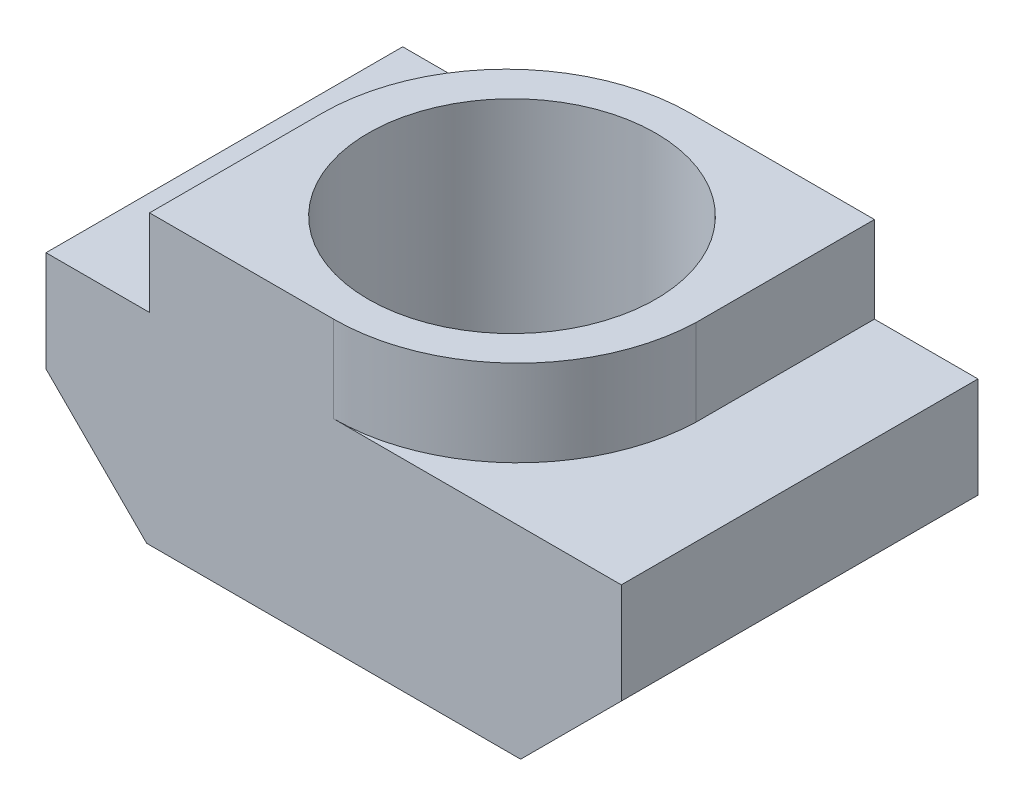
ISO-10303-21;
HEADER;
FILE_DESCRIPTION(('STEP AP214'),'2;1');
FILE_NAME('part.step','',(''),(''),'','','');
FILE_SCHEMA(('AUTOMOTIVE_DESIGN { 1 0 10303 214 1 1 1 1 }'));
ENDSEC;
DATA;
#1=APPLICATION_CONTEXT('core data for automotive mechanical design processes');
#2=APPLICATION_PROTOCOL_DEFINITION('international standard','automotive_design',2000,#1);
#3=PRODUCT_CONTEXT('',#1,'mechanical');
#4=PRODUCT('Part','Part','',(#3));
#5=PRODUCT_RELATED_PRODUCT_CATEGORY('part','',(#4));
#6=PRODUCT_DEFINITION_FORMATION('','',#4);
#7=PRODUCT_DEFINITION_CONTEXT('part definition',#1,'design');
#8=PRODUCT_DEFINITION('design','',#6,#7);
#9=PRODUCT_DEFINITION_SHAPE('','',#8);
#10=(LENGTH_UNIT() NAMED_UNIT(*) SI_UNIT(.MILLI.,.METRE.));
#11=(NAMED_UNIT(*) PLANE_ANGLE_UNIT() SI_UNIT($,.RADIAN.));
#12=(NAMED_UNIT(*) SI_UNIT($,.STERADIAN.) SOLID_ANGLE_UNIT());
#13=UNCERTAINTY_MEASURE_WITH_UNIT(LENGTH_MEASURE(1.E-05),#10,'distance_accuracy_value','');
#14=(GEOMETRIC_REPRESENTATION_CONTEXT(3) GLOBAL_UNCERTAINTY_ASSIGNED_CONTEXT((#13)) GLOBAL_UNIT_ASSIGNED_CONTEXT((#10,
#11,#12)) REPRESENTATION_CONTEXT('',''));
#15=CARTESIAN_POINT('',(0.,0.,0.));
#16=DIRECTION('',(0.,0.,1.));
#17=DIRECTION('',(1.,0.,0.));
#18=AXIS2_PLACEMENT_3D('',#15,#16,#17);
#19=CARTESIAN_POINT('',(3.2,5.,6.2));
#20=DIRECTION('',(0.,-1.,0.));
#21=DIRECTION('',(0.,0.,-1.));
#22=AXIS2_PLACEMENT_3D('',#19,#20,#21);
#23=PLANE('',#22);
#24=CARTESIAN_POINT('',(0.,5.,3.1));
#25=DIRECTION('',(0.,1.,0.));
#26=DIRECTION('',(0.,0.,1.));
#27=AXIS2_PLACEMENT_3D('',#24,#25,#26);
#28=CIRCLE('',#27,2.5);
#29=CARTESIAN_POINT('',(0.,5.,5.6));
#30=VERTEX_POINT('',#29);
#31=EDGE_CURVE('E167',#30,#30,#28,.T.);
#32=ORIENTED_EDGE('',*,*,#31,.F.);
#33=EDGE_LOOP('',(#32));
#34=FACE_BOUND('',#33,.T.);
#35=CARTESIAN_POINT('',(0.,5.,3.2));
#36=DIRECTION('',(0.,1.,0.));
#37=DIRECTION('',(0.,0.,1.));
#38=AXIS2_PLACEMENT_3D('',#35,#36,#37);
#39=CIRCLE('',#38,3.2);
#40=CARTESIAN_POINT('',(0.,5.,0.));
#41=VERTEX_POINT('',#40);
#42=CARTESIAN_POINT('',(-3.2,5.,3.2));
#43=VERTEX_POINT('',#42);
#44=EDGE_CURVE('E148',#41,#43,#39,.T.);
#45=ORIENTED_EDGE('',*,*,#44,.T.);
#46=DIRECTION('',(0.,0.,-1.));
#47=VECTOR('',#46,1.);
#48=CARTESIAN_POINT('',(-3.2,5.,6.2));
#49=LINE('',#48,#47);
#50=CARTESIAN_POINT('',(-3.2,5.,6.2));
#51=VERTEX_POINT('',#50);
#52=EDGE_CURVE('E181',#51,#43,#49,.T.);
#53=ORIENTED_EDGE('',*,*,#52,.F.);
#54=DIRECTION('',(-1.,0.,0.));
#55=VECTOR('',#54,1.);
#56=CARTESIAN_POINT('',(3.2,5.,6.2));
#57=LINE('',#56,#55);
#58=CARTESIAN_POINT('',(0.,5.,6.2));
#59=VERTEX_POINT('',#58);
#60=EDGE_CURVE('E197',#59,#51,#57,.T.);
#61=ORIENTED_EDGE('',*,*,#60,.F.);
#62=CARTESIAN_POINT('',(0.,5.,2.99838709677419));
#63=DIRECTION('',(0.,1.,0.));
#64=DIRECTION('',(0.,0.,1.));
#65=AXIS2_PLACEMENT_3D('',#62,#63,#64);
#66=CIRCLE('',#65,3.20161290322581);
#67=CARTESIAN_POINT('',(3.2,5.,3.1));
#68=VERTEX_POINT('',#67);
#69=EDGE_CURVE('E159',#59,#68,#66,.T.);
#70=ORIENTED_EDGE('',*,*,#69,.T.);
#71=DIRECTION('',(0.,0.,-1.));
#72=VECTOR('',#71,1.);
#73=CARTESIAN_POINT('',(3.2,5.,6.2));
#74=LINE('',#73,#72);
#75=CARTESIAN_POINT('',(3.2,5.,0.));
#76=VERTEX_POINT('',#75);
#77=EDGE_CURVE('E77',#68,#76,#74,.T.);
#78=ORIENTED_EDGE('',*,*,#77,.T.);
#79=DIRECTION('',(-1.,0.,0.));
#80=VECTOR('',#79,1.);
#81=CARTESIAN_POINT('',(3.2,5.,0.));
#82=LINE('',#81,#80);
#83=EDGE_CURVE('E196',#76,#41,#82,.T.);
#84=ORIENTED_EDGE('',*,*,#83,.T.);
#85=EDGE_LOOP('',(#45,#53,#61,#70,#78,#84));
#86=FACE_BOUND('',#85,.T.);
#87=ADVANCED_FACE('F32',(#34,#86),#23,.F.);
#88=CARTESIAN_POINT('',(-3.2,3.5,6.2));
#89=DIRECTION('',(1.,0.,0.));
#90=DIRECTION('',(0.,-1.,0.));
#91=AXIS2_PLACEMENT_3D('',#88,#89,#90);
#92=PLANE('',#91);
#93=DIRECTION('',(0.,1.,0.));
#94=VECTOR('',#93,1.);
#95=CARTESIAN_POINT('',(-3.2,3.5,3.2));
#96=LINE('',#95,#94);
#97=CARTESIAN_POINT('',(-3.2,3.5,3.2));
#98=VERTEX_POINT('',#97);
#99=EDGE_CURVE('E149',#98,#43,#96,.T.);
#100=ORIENTED_EDGE('',*,*,#99,.F.);
#101=DIRECTION('',(0.,0.,-1.));
#102=VECTOR('',#101,1.);
#103=CARTESIAN_POINT('',(-3.2,3.5,6.2));
#104=LINE('',#103,#102);
#105=CARTESIAN_POINT('',(-3.2,3.5,6.2));
#106=VERTEX_POINT('',#105);
#107=EDGE_CURVE('E155',#106,#98,#104,.T.);
#108=ORIENTED_EDGE('',*,*,#107,.F.);
#109=DIRECTION('',(0.,1.,0.));
#110=VECTOR('',#109,1.);
#111=CARTESIAN_POINT('',(-3.2,3.5,6.2));
#112=LINE('',#111,#110);
#113=EDGE_CURVE('E178',#106,#51,#112,.T.);
#114=ORIENTED_EDGE('',*,*,#113,.T.);
#115=ORIENTED_EDGE('',*,*,#52,.T.);
#116=EDGE_LOOP('',(#100,#108,#114,#115));
#117=FACE_BOUND('',#116,.T.);
#118=ADVANCED_FACE('F243',(#117),#92,.F.);
#119=CARTESIAN_POINT('',(3.2,3.5,6.2));
#120=DIRECTION('',(-1.,0.,0.));
#121=DIRECTION('',(0.,-1.,0.));
#122=AXIS2_PLACEMENT_3D('',#119,#120,#121);
#123=PLANE('',#122);
#124=DIRECTION('',(0.,1.,0.));
#125=VECTOR('',#124,1.);
#126=CARTESIAN_POINT('',(3.2,3.5,3.1));
#127=LINE('',#126,#125);
#128=CARTESIAN_POINT('',(3.2,3.5,3.1));
#129=VERTEX_POINT('',#128);
#130=EDGE_CURVE('E165',#129,#68,#127,.T.);
#131=ORIENTED_EDGE('',*,*,#130,.F.);
#132=DIRECTION('',(0.,0.,-1.));
#133=VECTOR('',#132,1.);
#134=CARTESIAN_POINT('',(3.2,3.5,6.2));
#135=LINE('',#134,#133);
#136=CARTESIAN_POINT('',(3.2,3.5,0.));
#137=VERTEX_POINT('',#136);
#138=EDGE_CURVE('E217',#129,#137,#135,.T.);
#139=ORIENTED_EDGE('',*,*,#138,.T.);
#140=DIRECTION('',(0.,1.,0.));
#141=VECTOR('',#140,1.);
#142=CARTESIAN_POINT('',(3.2,3.5,0.));
#143=LINE('',#142,#141);
#144=EDGE_CURVE('E199',#137,#76,#143,.T.);
#145=ORIENTED_EDGE('',*,*,#144,.T.);
#146=ORIENTED_EDGE('',*,*,#77,.F.);
#147=EDGE_LOOP('',(#131,#139,#145,#146));
#148=FACE_BOUND('',#147,.T.);
#149=ADVANCED_FACE('F267',(#148),#123,.F.);
#150=CARTESIAN_POINT('',(0.,0.,6.2));
#151=DIRECTION('',(0.,0.,1.));
#152=DIRECTION('',(1.,0.,0.));
#153=AXIS2_PLACEMENT_3D('',#150,#151,#152);
#154=PLANE('',#153);
#155=DIRECTION('',(-1.,0.,0.));
#156=VECTOR('',#155,1.);
#157=CARTESIAN_POINT('',(5.,3.5,6.2));
#158=LINE('',#157,#156);
#159=CARTESIAN_POINT('',(5.,3.5,6.2));
#160=VERTEX_POINT('',#159);
#161=CARTESIAN_POINT('',(0.,3.5,6.2));
#162=VERTEX_POINT('',#161);
#163=EDGE_CURVE('E47',#160,#162,#158,.T.);
#164=ORIENTED_EDGE('',*,*,#163,.T.);
#165=DIRECTION('',(0.,1.,0.));
#166=VECTOR('',#165,1.);
#167=CARTESIAN_POINT('',(0.,3.5,6.2));
#168=LINE('',#167,#166);
#169=EDGE_CURVE('E163',#162,#59,#168,.T.);
#170=ORIENTED_EDGE('',*,*,#169,.T.);
#171=ORIENTED_EDGE('',*,*,#60,.T.);
#172=ORIENTED_EDGE('',*,*,#113,.F.);
#173=DIRECTION('',(1.,0.,0.));
#174=VECTOR('',#173,1.);
#175=CARTESIAN_POINT('',(-5.,3.5,6.2));
#176=LINE('',#175,#174);
#177=CARTESIAN_POINT('',(-5.,3.5,6.2));
#178=VERTEX_POINT('',#177);
#179=EDGE_CURVE('E176',#178,#106,#176,.T.);
#180=ORIENTED_EDGE('',*,*,#179,.F.);
#181=DIRECTION('',(0.,1.,0.));
#182=VECTOR('',#181,1.);
#183=CARTESIAN_POINT('',(-5.,1.75,6.2));
#184=LINE('',#183,#182);
#185=CARTESIAN_POINT('',(-5.,1.75,6.2));
#186=VERTEX_POINT('',#185);
#187=EDGE_CURVE('E173',#186,#178,#184,.T.);
#188=ORIENTED_EDGE('',*,*,#187,.F.);
#189=DIRECTION('',(-0.707106781186551,0.707106781186544,0.));
#190=VECTOR('',#189,1.);
#191=CARTESIAN_POINT('',(-3.24999999999998,0.,6.2));
#192=LINE('',#191,#190);
#193=CARTESIAN_POINT('',(-3.24999999999998,0.,6.2));
#194=VERTEX_POINT('',#193);
#195=EDGE_CURVE('E141',#194,#186,#192,.T.);
#196=ORIENTED_EDGE('',*,*,#195,.F.);
#197=DIRECTION('',(1.,0.,0.));
#198=VECTOR('',#197,1.);
#199=CARTESIAN_POINT('',(0.,0.,6.2));
#200=LINE('',#199,#198);
#201=CARTESIAN_POINT('',(3.24999999999998,0.,6.2));
#202=VERTEX_POINT('',#201);
#203=EDGE_CURVE('E82',#194,#202,#200,.T.);
#204=ORIENTED_EDGE('',*,*,#203,.T.);
#205=DIRECTION('',(0.707106781186551,0.707106781186544,0.));
#206=VECTOR('',#205,1.);
#207=CARTESIAN_POINT('',(3.24999999999998,0.,6.2));
#208=LINE('',#207,#206);
#209=CARTESIAN_POINT('',(5.,1.75,6.2));
#210=VERTEX_POINT('',#209);
#211=EDGE_CURVE('E201',#202,#210,#208,.T.);
#212=ORIENTED_EDGE('',*,*,#211,.T.);
#213=DIRECTION('',(0.,1.,0.));
#214=VECTOR('',#213,1.);
#215=CARTESIAN_POINT('',(5.,1.75,6.2));
#216=LINE('',#215,#214);
#217=EDGE_CURVE('E53',#210,#160,#216,.T.);
#218=ORIENTED_EDGE('',*,*,#217,.T.);
#219=EDGE_LOOP('',(#164,#170,#171,#172,#180,#188,#196,#204,#212,#218));
#220=FACE_BOUND('',#219,.T.);
#221=ADVANCED_FACE('F240',(#220),#154,.T.);
#222=CARTESIAN_POINT('',(0.,0.,6.2));
#223=DIRECTION('',(0.,1.,0.));
#224=DIRECTION('',(0.,0.,1.));
#225=AXIS2_PLACEMENT_3D('',#222,#223,#224);
#226=PLANE('',#225);
#227=CARTESIAN_POINT('',(0.,0.,3.1));
#228=DIRECTION('',(0.,1.,0.));
#229=DIRECTION('',(0.,0.,1.));
#230=AXIS2_PLACEMENT_3D('',#227,#228,#229);
#231=CIRCLE('',#230,2.5);
#232=CARTESIAN_POINT('',(0.,0.,5.6));
#233=VERTEX_POINT('',#232);
#234=EDGE_CURVE('E35',#233,#233,#231,.T.);
#235=ORIENTED_EDGE('',*,*,#234,.T.);
#236=EDGE_LOOP('',(#235));
#237=FACE_BOUND('',#236,.T.);
#238=DIRECTION('',(1.,0.,0.));
#239=VECTOR('',#238,1.);
#240=CARTESIAN_POINT('',(0.,0.,0.));
#241=LINE('',#240,#239);
#242=CARTESIAN_POINT('',(-3.24999999999998,0.,0.));
#243=VERTEX_POINT('',#242);
#244=CARTESIAN_POINT('',(3.24999999999998,0.,0.));
#245=VERTEX_POINT('',#244);
#246=EDGE_CURVE('E206',#243,#245,#241,.T.);
#247=ORIENTED_EDGE('',*,*,#246,.T.);
#248=DIRECTION('',(0.,0.,-1.));
#249=VECTOR('',#248,1.);
#250=CARTESIAN_POINT('',(3.24999999999998,0.,6.2));
#251=LINE('',#250,#249);
#252=EDGE_CURVE('E11',#202,#245,#251,.T.);
#253=ORIENTED_EDGE('',*,*,#252,.F.);
#254=ORIENTED_EDGE('',*,*,#203,.F.);
#255=DIRECTION('',(0.,0.,-1.));
#256=VECTOR('',#255,1.);
#257=CARTESIAN_POINT('',(-3.24999999999998,0.,6.2));
#258=LINE('',#257,#256);
#259=EDGE_CURVE('E193',#194,#243,#258,.T.);
#260=ORIENTED_EDGE('',*,*,#259,.T.);
#261=EDGE_LOOP('',(#247,#253,#254,#260));
#262=FACE_BOUND('',#261,.T.);
#263=ADVANCED_FACE('F252',(#237,#262),#226,.F.);
#264=CARTESIAN_POINT('',(3.24999999999998,0.,6.2));
#265=DIRECTION('',(-0.707106781186544,0.707106781186551,0.));
#266=DIRECTION('',(-0.707106781186551,-0.707106781186544,0.));
#267=AXIS2_PLACEMENT_3D('',#264,#265,#266);
#268=PLANE('',#267);
#269=DIRECTION('',(0.707106781186551,0.707106781186544,0.));
#270=VECTOR('',#269,1.);
#271=CARTESIAN_POINT('',(3.24999999999998,0.,0.));
#272=LINE('',#271,#270);
#273=CARTESIAN_POINT('',(5.,1.75,0.));
#274=VERTEX_POINT('',#273);
#275=EDGE_CURVE('E208',#245,#274,#272,.T.);
#276=ORIENTED_EDGE('',*,*,#275,.T.);
#277=DIRECTION('',(0.,0.,-1.));
#278=VECTOR('',#277,1.);
#279=CARTESIAN_POINT('',(5.,1.75,6.2));
#280=LINE('',#279,#278);
#281=EDGE_CURVE('E40',#210,#274,#280,.T.);
#282=ORIENTED_EDGE('',*,*,#281,.F.);
#283=ORIENTED_EDGE('',*,*,#211,.F.);
#284=ORIENTED_EDGE('',*,*,#252,.T.);
#285=EDGE_LOOP('',(#276,#282,#283,#284));
#286=FACE_BOUND('',#285,.T.);
#287=ADVANCED_FACE('F253',(#286),#268,.F.);
#288=CARTESIAN_POINT('',(5.,1.75,6.2));
#289=DIRECTION('',(-1.,0.,0.));
#290=DIRECTION('',(0.,0.,1.));
#291=AXIS2_PLACEMENT_3D('',#288,#289,#290);
#292=PLANE('',#291);
#293=DIRECTION('',(0.,1.,0.));
#294=VECTOR('',#293,1.);
#295=CARTESIAN_POINT('',(5.,1.75,0.));
#296=LINE('',#295,#294);
#297=CARTESIAN_POINT('',(5.,3.5,0.));
#298=VERTEX_POINT('',#297);
#299=EDGE_CURVE('E210',#274,#298,#296,.T.);
#300=ORIENTED_EDGE('',*,*,#299,.T.);
#301=DIRECTION('',(0.,0.,-1.));
#302=VECTOR('',#301,1.);
#303=CARTESIAN_POINT('',(5.,3.5,6.2));
#304=LINE('',#303,#302);
#305=EDGE_CURVE('E219',#160,#298,#304,.T.);
#306=ORIENTED_EDGE('',*,*,#305,.F.);
#307=ORIENTED_EDGE('',*,*,#217,.F.);
#308=ORIENTED_EDGE('',*,*,#281,.T.);
#309=EDGE_LOOP('',(#300,#306,#307,#308));
#310=FACE_BOUND('',#309,.T.);
#311=ADVANCED_FACE('F226',(#310),#292,.F.);
#312=CARTESIAN_POINT('',(5.,3.5,6.2));
#313=DIRECTION('',(0.,-1.,0.));
#314=DIRECTION('',(0.,0.,-1.));
#315=AXIS2_PLACEMENT_3D('',#312,#313,#314);
#316=PLANE('',#315);
#317=DIRECTION('',(-1.,0.,0.));
#318=VECTOR('',#317,1.);
#319=CARTESIAN_POINT('',(5.,3.5,0.));
#320=LINE('',#319,#318);
#321=EDGE_CURVE('E212',#298,#137,#320,.T.);
#322=ORIENTED_EDGE('',*,*,#321,.T.);
#323=ORIENTED_EDGE('',*,*,#138,.F.);
#324=CARTESIAN_POINT('',(0.,3.5,2.99838709677419));
#325=DIRECTION('',(0.,1.,0.));
#326=DIRECTION('',(0.,0.,1.));
#327=AXIS2_PLACEMENT_3D('',#324,#325,#326);
#328=CIRCLE('',#327,3.20161290322581);
#329=EDGE_CURVE('E161',#162,#129,#328,.T.);
#330=ORIENTED_EDGE('',*,*,#329,.F.);
#331=ORIENTED_EDGE('',*,*,#163,.F.);
#332=ORIENTED_EDGE('',*,*,#305,.T.);
#333=EDGE_LOOP('',(#322,#323,#330,#331,#332));
#334=FACE_BOUND('',#333,.T.);
#335=ADVANCED_FACE('F234',(#334),#316,.F.);
#336=CARTESIAN_POINT('',(0.,0.,0.));
#337=DIRECTION('',(0.,0.,1.));
#338=DIRECTION('',(1.,0.,0.));
#339=AXIS2_PLACEMENT_3D('',#336,#337,#338);
#340=PLANE('',#339);
#341=DIRECTION('',(1.,0.,0.));
#342=VECTOR('',#341,1.);
#343=CARTESIAN_POINT('',(-5.,3.5,0.));
#344=LINE('',#343,#342);
#345=CARTESIAN_POINT('',(-5.,3.5,0.));
#346=VERTEX_POINT('',#345);
#347=CARTESIAN_POINT('',(0.,3.5,0.));
#348=VERTEX_POINT('',#347);
#349=EDGE_CURVE('E130',#346,#348,#344,.T.);
#350=ORIENTED_EDGE('',*,*,#349,.T.);
#351=DIRECTION('',(0.,1.,0.));
#352=VECTOR('',#351,1.);
#353=CARTESIAN_POINT('',(0.,3.5,0.));
#354=LINE('',#353,#352);
#355=EDGE_CURVE('E134',#348,#41,#354,.T.);
#356=ORIENTED_EDGE('',*,*,#355,.T.);
#357=ORIENTED_EDGE('',*,*,#83,.F.);
#358=ORIENTED_EDGE('',*,*,#144,.F.);
#359=ORIENTED_EDGE('',*,*,#321,.F.);
#360=ORIENTED_EDGE('',*,*,#299,.F.);
#361=ORIENTED_EDGE('',*,*,#275,.F.);
#362=ORIENTED_EDGE('',*,*,#246,.F.);
#363=DIRECTION('',(-0.707106781186551,0.707106781186544,0.));
#364=VECTOR('',#363,1.);
#365=CARTESIAN_POINT('',(-3.24999999999998,0.,0.));
#366=LINE('',#365,#364);
#367=CARTESIAN_POINT('',(-5.,1.75,0.));
#368=VERTEX_POINT('',#367);
#369=EDGE_CURVE('E182',#243,#368,#366,.T.);
#370=ORIENTED_EDGE('',*,*,#369,.T.);
#371=DIRECTION('',(0.,1.,0.));
#372=VECTOR('',#371,1.);
#373=CARTESIAN_POINT('',(-5.,1.75,0.));
#374=LINE('',#373,#372);
#375=EDGE_CURVE('E136',#368,#346,#374,.T.);
#376=ORIENTED_EDGE('',*,*,#375,.T.);
#377=EDGE_LOOP('',(#350,#356,#357,#358,#359,#360,#361,#362,#370,#376));
#378=FACE_BOUND('',#377,.T.);
#379=ADVANCED_FACE('F132',(#378),#340,.F.);
#380=CARTESIAN_POINT('',(-3.24999999999998,0.,6.2));
#381=DIRECTION('',(0.707106781186544,0.707106781186551,0.));
#382=DIRECTION('',(0.707106781186551,-0.707106781186544,0.));
#383=AXIS2_PLACEMENT_3D('',#380,#381,#382);
#384=PLANE('',#383);
#385=ORIENTED_EDGE('',*,*,#369,.F.);
#386=ORIENTED_EDGE('',*,*,#259,.F.);
#387=ORIENTED_EDGE('',*,*,#195,.T.);
#388=DIRECTION('',(0.,0.,-1.));
#389=VECTOR('',#388,1.);
#390=CARTESIAN_POINT('',(-5.,1.75,6.2));
#391=LINE('',#390,#389);
#392=EDGE_CURVE('E190',#186,#368,#391,.T.);
#393=ORIENTED_EDGE('',*,*,#392,.T.);
#394=EDGE_LOOP('',(#385,#386,#387,#393));
#395=FACE_BOUND('',#394,.T.);
#396=ADVANCED_FACE('F250',(#395),#384,.F.);
#397=CARTESIAN_POINT('',(-5.,1.75,6.2));
#398=DIRECTION('',(1.,0.,0.));
#399=DIRECTION('',(0.,0.,1.));
#400=AXIS2_PLACEMENT_3D('',#397,#398,#399);
#401=PLANE('',#400);
#402=ORIENTED_EDGE('',*,*,#375,.F.);
#403=ORIENTED_EDGE('',*,*,#392,.F.);
#404=ORIENTED_EDGE('',*,*,#187,.T.);
#405=DIRECTION('',(0.,0.,-1.));
#406=VECTOR('',#405,1.);
#407=CARTESIAN_POINT('',(-5.,3.5,6.2));
#408=LINE('',#407,#406);
#409=EDGE_CURVE('E188',#178,#346,#408,.T.);
#410=ORIENTED_EDGE('',*,*,#409,.T.);
#411=EDGE_LOOP('',(#402,#403,#404,#410));
#412=FACE_BOUND('',#411,.T.);
#413=ADVANCED_FACE('F246',(#412),#401,.F.);
#414=CARTESIAN_POINT('',(-5.,3.5,6.2));
#415=DIRECTION('',(0.,-1.,0.));
#416=DIRECTION('',(0.,0.,-1.));
#417=AXIS2_PLACEMENT_3D('',#414,#415,#416);
#418=PLANE('',#417);
#419=ORIENTED_EDGE('',*,*,#349,.F.);
#420=ORIENTED_EDGE('',*,*,#409,.F.);
#421=ORIENTED_EDGE('',*,*,#179,.T.);
#422=ORIENTED_EDGE('',*,*,#107,.T.);
#423=CARTESIAN_POINT('',(0.,3.5,3.2));
#424=DIRECTION('',(0.,1.,0.));
#425=DIRECTION('',(0.,0.,1.));
#426=AXIS2_PLACEMENT_3D('',#423,#424,#425);
#427=CIRCLE('',#426,3.2);
#428=EDGE_CURVE('E145',#348,#98,#427,.T.);
#429=ORIENTED_EDGE('',*,*,#428,.F.);
#430=EDGE_LOOP('',(#419,#420,#421,#422,#429));
#431=FACE_BOUND('',#430,.T.);
#432=ADVANCED_FACE('F152',(#431),#418,.F.);
#433=CARTESIAN_POINT('',(0.,-3.,3.1));
#434=DIRECTION('',(0.,1.,0.));
#435=DIRECTION('',(0.,0.,1.));
#436=AXIS2_PLACEMENT_3D('',#433,#434,#435);
#437=CYLINDRICAL_SURFACE('',#436,2.5);
#438=ORIENTED_EDGE('',*,*,#31,.T.);
#439=EDGE_LOOP('',(#438));
#440=FACE_BOUND('',#439,.T.);
#441=ORIENTED_EDGE('',*,*,#234,.F.);
#442=EDGE_LOOP('',(#441));
#443=FACE_BOUND('',#442,.T.);
#444=ADVANCED_FACE('F271',(#440,#443),#437,.F.);
#445=CARTESIAN_POINT('',(0.,3.5,2.99838709677419));
#446=DIRECTION('',(0.,1.,0.));
#447=DIRECTION('',(0.,0.,1.));
#448=AXIS2_PLACEMENT_3D('',#445,#446,#447);
#449=CYLINDRICAL_SURFACE('',#448,3.20161290322581);
#450=ORIENTED_EDGE('',*,*,#69,.F.);
#451=ORIENTED_EDGE('',*,*,#169,.F.);
#452=ORIENTED_EDGE('',*,*,#329,.T.);
#453=ORIENTED_EDGE('',*,*,#130,.T.);
#454=EDGE_LOOP('',(#450,#451,#452,#453));
#455=FACE_BOUND('',#454,.T.);
#456=ADVANCED_FACE('F238',(#455),#449,.T.);
#457=CARTESIAN_POINT('',(0.,3.5,3.2));
#458=DIRECTION('',(0.,1.,0.));
#459=DIRECTION('',(0.,0.,1.));
#460=AXIS2_PLACEMENT_3D('',#457,#458,#459);
#461=CYLINDRICAL_SURFACE('',#460,3.2);
#462=ORIENTED_EDGE('',*,*,#44,.F.);
#463=ORIENTED_EDGE('',*,*,#355,.F.);
#464=ORIENTED_EDGE('',*,*,#428,.T.);
#465=ORIENTED_EDGE('',*,*,#99,.T.);
#466=EDGE_LOOP('',(#462,#463,#464,#465));
#467=FACE_BOUND('',#466,.T.);
#468=ADVANCED_FACE('F144',(#467),#461,.T.);
#469=CLOSED_SHELL('',(#87,#118,#149,#221,#263,#287,#311,#335,#379,#396,#413,#432,#444,#456,#468));
#470=MANIFOLD_SOLID_BREP('B2',#469);
#471=ADVANCED_BREP_SHAPE_REPRESENTATION('',(#18,#470),#14);
#472=SHAPE_DEFINITION_REPRESENTATION(#9,#471);
ENDSEC;
END-ISO-10303-21;
